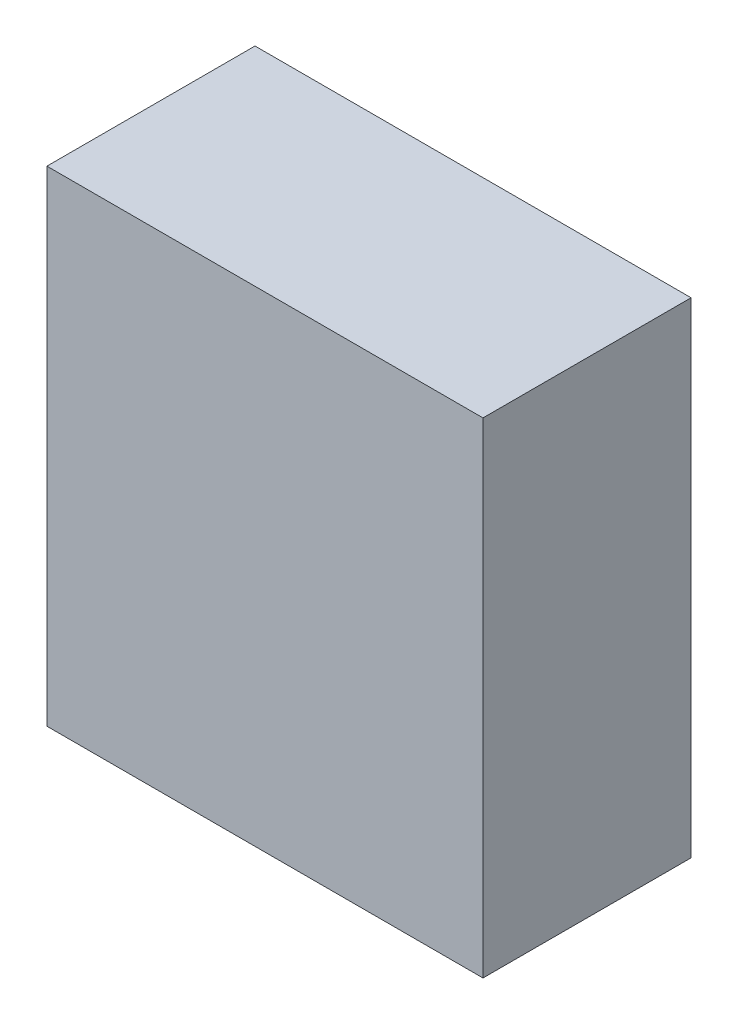
ISO-10303-21;
HEADER;
FILE_DESCRIPTION(('STEP AP214'),'2;1');
FILE_NAME('part.step','',(''),(''),'','','');
FILE_SCHEMA(('AUTOMOTIVE_DESIGN { 1 0 10303 214 1 1 1 1 }'));
ENDSEC;
DATA;
#1=APPLICATION_CONTEXT('core data for automotive mechanical design processes');
#2=APPLICATION_PROTOCOL_DEFINITION('international standard','automotive_design',2000,#1);
#3=PRODUCT_CONTEXT('',#1,'mechanical');
#4=PRODUCT('Part','Part','',(#3));
#5=PRODUCT_RELATED_PRODUCT_CATEGORY('part','',(#4));
#6=PRODUCT_DEFINITION_FORMATION('','',#4);
#7=PRODUCT_DEFINITION_CONTEXT('part definition',#1,'design');
#8=PRODUCT_DEFINITION('design','',#6,#7);
#9=PRODUCT_DEFINITION_SHAPE('','',#8);
#10=(LENGTH_UNIT() NAMED_UNIT(*) SI_UNIT(.MILLI.,.METRE.));
#11=(NAMED_UNIT(*) PLANE_ANGLE_UNIT() SI_UNIT($,.RADIAN.));
#12=(NAMED_UNIT(*) SI_UNIT($,.STERADIAN.) SOLID_ANGLE_UNIT());
#13=UNCERTAINTY_MEASURE_WITH_UNIT(LENGTH_MEASURE(1.E-05),#10,'distance_accuracy_value','');
#14=(GEOMETRIC_REPRESENTATION_CONTEXT(3) GLOBAL_UNCERTAINTY_ASSIGNED_CONTEXT((#13)) GLOBAL_UNIT_ASSIGNED_CONTEXT((#10,
#11,#12)) REPRESENTATION_CONTEXT('',''));
#15=CARTESIAN_POINT('',(0.,0.,0.));
#16=DIRECTION('',(0.,0.,1.));
#17=DIRECTION('',(1.,0.,0.));
#18=AXIS2_PLACEMENT_3D('',#15,#16,#17);
#19=CARTESIAN_POINT('',(-70.64375,-72.23125,-61.07176));
#20=DIRECTION('',(1.,0.,0.));
#21=DIRECTION('',(0.,0.,-1.));
#22=AXIS2_PLACEMENT_3D('',#19,#20,#21);
#23=PLANE('',#22);
#24=DIRECTION('',(0.,1.,0.));
#25=VECTOR('',#24,1.);
#26=CARTESIAN_POINT('',(-70.64375,-72.23125,6.35));
#27=LINE('',#26,#25);
#28=CARTESIAN_POINT('',(-70.64375,-78.58125,6.35));
#29=VERTEX_POINT('',#28);
#30=CARTESIAN_POINT('',(-70.64375,78.58125,6.35));
#31=VERTEX_POINT('',#30);
#32=EDGE_CURVE('E133',#29,#31,#27,.T.);
#33=ORIENTED_EDGE('',*,*,#32,.T.);
#34=DIRECTION('',(0.,0.,1.));
#35=VECTOR('',#34,1.);
#36=CARTESIAN_POINT('',(-70.64375,78.58125,-61.07176));
#37=LINE('',#36,#35);
#38=CARTESIAN_POINT('',(-70.64375,78.58125,-61.07176));
#39=VERTEX_POINT('',#38);
#40=EDGE_CURVE('E11',#39,#31,#37,.T.);
#41=ORIENTED_EDGE('',*,*,#40,.F.);
#42=DIRECTION('',(0.,1.,0.));
#43=VECTOR('',#42,1.);
#44=CARTESIAN_POINT('',(-70.64375,-72.23125,-61.07176));
#45=LINE('',#44,#43);
#46=CARTESIAN_POINT('',(-70.64375,-78.58125,-61.07176));
#47=VERTEX_POINT('',#46);
#48=EDGE_CURVE('E187',#47,#39,#45,.T.);
#49=ORIENTED_EDGE('',*,*,#48,.F.);
#50=DIRECTION('',(0.,0.,1.));
#51=VECTOR('',#50,1.);
#52=CARTESIAN_POINT('',(-70.64375,-78.58125,-61.07176));
#53=LINE('',#52,#51);
#54=EDGE_CURVE('E69',#47,#29,#53,.T.);
#55=ORIENTED_EDGE('',*,*,#54,.T.);
#56=EDGE_LOOP('',(#33,#41,#49,#55));
#57=FACE_BOUND('',#56,.T.);
#58=ADVANCED_FACE('F43',(#57),#23,.F.);
#59=CARTESIAN_POINT('',(-64.29375,78.58125,-61.07176));
#60=DIRECTION('',(0.,-1.,0.));
#61=DIRECTION('',(0.,0.,-1.));
#62=AXIS2_PLACEMENT_3D('',#59,#60,#61);
#63=PLANE('',#62);
#64=DIRECTION('',(1.,0.,0.));
#65=VECTOR('',#64,1.);
#66=CARTESIAN_POINT('',(-64.29375,78.58125,6.35));
#67=LINE('',#66,#65);
#68=CARTESIAN_POINT('',(70.64375,78.58125,6.35));
#69=VERTEX_POINT('',#68);
#70=EDGE_CURVE('E167',#31,#69,#67,.T.);
#71=ORIENTED_EDGE('',*,*,#70,.T.);
#72=DIRECTION('',(0.,0.,1.));
#73=VECTOR('',#72,1.);
#74=CARTESIAN_POINT('',(70.64375,78.58125,-61.07176));
#75=LINE('',#74,#73);
#76=CARTESIAN_POINT('',(70.64375,78.58125,-61.07176));
#77=VERTEX_POINT('',#76);
#78=EDGE_CURVE('E53',#77,#69,#75,.T.);
#79=ORIENTED_EDGE('',*,*,#78,.F.);
#80=DIRECTION('',(1.,0.,0.));
#81=VECTOR('',#80,1.);
#82=CARTESIAN_POINT('',(-64.29375,78.58125,-61.07176));
#83=LINE('',#82,#81);
#84=EDGE_CURVE('E191',#39,#77,#83,.T.);
#85=ORIENTED_EDGE('',*,*,#84,.F.);
#86=ORIENTED_EDGE('',*,*,#40,.T.);
#87=EDGE_LOOP('',(#71,#79,#85,#86));
#88=FACE_BOUND('',#87,.T.);
#89=ADVANCED_FACE('F205',(#88),#63,.F.);
#90=CARTESIAN_POINT('',(70.64375,-72.23125,-61.07176));
#91=DIRECTION('',(1.,0.,0.));
#92=DIRECTION('',(0.,0.,-1.));
#93=AXIS2_PLACEMENT_3D('',#90,#91,#92);
#94=PLANE('',#93);
#95=DIRECTION('',(0.,1.,0.));
#96=VECTOR('',#95,1.);
#97=CARTESIAN_POINT('',(70.64375,-72.23125,6.35));
#98=LINE('',#97,#96);
#99=CARTESIAN_POINT('',(70.64375,-78.58125,6.35));
#100=VERTEX_POINT('',#99);
#101=EDGE_CURVE('E175',#100,#69,#98,.T.);
#102=ORIENTED_EDGE('',*,*,#101,.F.);
#103=DIRECTION('',(0.,0.,1.));
#104=VECTOR('',#103,1.);
#105=CARTESIAN_POINT('',(70.64375,-78.58125,-61.07176));
#106=LINE('',#105,#104);
#107=CARTESIAN_POINT('',(70.64375,-78.58125,-61.07176));
#108=VERTEX_POINT('',#107);
#109=EDGE_CURVE('E171',#108,#100,#106,.T.);
#110=ORIENTED_EDGE('',*,*,#109,.F.);
#111=DIRECTION('',(0.,1.,0.));
#112=VECTOR('',#111,1.);
#113=CARTESIAN_POINT('',(70.64375,-72.23125,-61.07176));
#114=LINE('',#113,#112);
#115=EDGE_CURVE('E193',#108,#77,#114,.T.);
#116=ORIENTED_EDGE('',*,*,#115,.T.);
#117=ORIENTED_EDGE('',*,*,#78,.T.);
#118=EDGE_LOOP('',(#102,#110,#116,#117));
#119=FACE_BOUND('',#118,.T.);
#120=ADVANCED_FACE('F206',(#119),#94,.T.);
#121=CARTESIAN_POINT('',(-64.29375,-78.58125,-61.07176));
#122=DIRECTION('',(0.,-1.,0.));
#123=DIRECTION('',(0.,0.,-1.));
#124=AXIS2_PLACEMENT_3D('',#121,#122,#123);
#125=PLANE('',#124);
#126=DIRECTION('',(1.,0.,0.));
#127=VECTOR('',#126,1.);
#128=CARTESIAN_POINT('',(-64.29375,-78.58125,6.35));
#129=LINE('',#128,#127);
#130=EDGE_CURVE('E181',#29,#100,#129,.T.);
#131=ORIENTED_EDGE('',*,*,#130,.F.);
#132=ORIENTED_EDGE('',*,*,#54,.F.);
#133=DIRECTION('',(1.,0.,0.));
#134=VECTOR('',#133,1.);
#135=CARTESIAN_POINT('',(-64.29375,-78.58125,-61.07176));
#136=LINE('',#135,#134);
#137=EDGE_CURVE('E47',#47,#108,#136,.T.);
#138=ORIENTED_EDGE('',*,*,#137,.T.);
#139=ORIENTED_EDGE('',*,*,#109,.T.);
#140=EDGE_LOOP('',(#131,#132,#138,#139));
#141=FACE_BOUND('',#140,.T.);
#142=ADVANCED_FACE('F200',(#141),#125,.T.);
#143=CARTESIAN_POINT('',(0.,0.,-61.07176));
#144=DIRECTION('',(0.,0.,-1.));
#145=DIRECTION('',(-1.,0.,0.));
#146=AXIS2_PLACEMENT_3D('',#143,#144,#145);
#147=PLANE('',#146);
#148=DIRECTION('',(0.,1.,0.));
#149=VECTOR('',#148,1.);
#150=CARTESIAN_POINT('',(-64.29375,-72.23125,-61.07176));
#151=LINE('',#150,#149);
#152=CARTESIAN_POINT('',(-64.29375,-72.23125,-61.07176));
#153=VERTEX_POINT('',#152);
#154=CARTESIAN_POINT('',(-64.29375,72.23125,-61.07176));
#155=VERTEX_POINT('',#154);
#156=EDGE_CURVE('E113',#153,#155,#151,.T.);
#157=ORIENTED_EDGE('',*,*,#156,.F.);
#158=DIRECTION('',(1.,0.,0.));
#159=VECTOR('',#158,1.);
#160=CARTESIAN_POINT('',(-64.29375,-72.23125,-61.07176));
#161=LINE('',#160,#159);
#162=CARTESIAN_POINT('',(64.29375,-72.23125,-61.07176));
#163=VERTEX_POINT('',#162);
#164=EDGE_CURVE('E141',#153,#163,#161,.T.);
#165=ORIENTED_EDGE('',*,*,#164,.T.);
#166=DIRECTION('',(0.,1.,0.));
#167=VECTOR('',#166,1.);
#168=CARTESIAN_POINT('',(64.29375,-72.23125,-61.07176));
#169=LINE('',#168,#167);
#170=CARTESIAN_POINT('',(64.29375,72.23125,-61.07176));
#171=VERTEX_POINT('',#170);
#172=EDGE_CURVE('E61',#163,#171,#169,.T.);
#173=ORIENTED_EDGE('',*,*,#172,.T.);
#174=DIRECTION('',(1.,0.,0.));
#175=VECTOR('',#174,1.);
#176=CARTESIAN_POINT('',(-64.29375,72.23125,-61.07176));
#177=LINE('',#176,#175);
#178=EDGE_CURVE('E125',#155,#171,#177,.T.);
#179=ORIENTED_EDGE('',*,*,#178,.F.);
#180=EDGE_LOOP('',(#157,#165,#173,#179));
#181=FACE_BOUND('',#180,.T.);
#182=ORIENTED_EDGE('',*,*,#48,.T.);
#183=ORIENTED_EDGE('',*,*,#84,.T.);
#184=ORIENTED_EDGE('',*,*,#115,.F.);
#185=ORIENTED_EDGE('',*,*,#137,.F.);
#186=EDGE_LOOP('',(#182,#183,#184,#185));
#187=FACE_BOUND('',#186,.T.);
#188=ADVANCED_FACE('F136',(#181,#187),#147,.T.);
#189=CARTESIAN_POINT('',(0.,0.,6.35));
#190=DIRECTION('',(0.,0.,-1.));
#191=DIRECTION('',(-1.,0.,0.));
#192=AXIS2_PLACEMENT_3D('',#189,#190,#191);
#193=PLANE('',#192);
#194=ORIENTED_EDGE('',*,*,#32,.F.);
#195=ORIENTED_EDGE('',*,*,#130,.T.);
#196=ORIENTED_EDGE('',*,*,#101,.T.);
#197=ORIENTED_EDGE('',*,*,#70,.F.);
#198=EDGE_LOOP('',(#194,#195,#196,#197));
#199=FACE_BOUND('',#198,.T.);
#200=ADVANCED_FACE('F45',(#199),#193,.F.);
#201=CARTESIAN_POINT('',(-64.29375,-72.23125,-61.07176));
#202=DIRECTION('',(1.,0.,0.));
#203=DIRECTION('',(0.,0.,-1.));
#204=AXIS2_PLACEMENT_3D('',#201,#202,#203);
#205=PLANE('',#204);
#206=DIRECTION('',(0.,1.,0.));
#207=VECTOR('',#206,1.);
#208=CARTESIAN_POINT('',(-64.29375,-72.23125,0.));
#209=LINE('',#208,#207);
#210=CARTESIAN_POINT('',(-64.29375,-72.23125,0.));
#211=VERTEX_POINT('',#210);
#212=CARTESIAN_POINT('',(-64.29375,72.23125,0.));
#213=VERTEX_POINT('',#212);
#214=EDGE_CURVE('E146',#211,#213,#209,.T.);
#215=ORIENTED_EDGE('',*,*,#214,.F.);
#216=DIRECTION('',(0.,0.,1.));
#217=VECTOR('',#216,1.);
#218=CARTESIAN_POINT('',(-64.29375,-72.23125,-61.07176));
#219=LINE('',#218,#217);
#220=EDGE_CURVE('E119',#153,#211,#219,.T.);
#221=ORIENTED_EDGE('',*,*,#220,.F.);
#222=ORIENTED_EDGE('',*,*,#156,.T.);
#223=DIRECTION('',(0.,0.,1.));
#224=VECTOR('',#223,1.);
#225=CARTESIAN_POINT('',(-64.29375,72.23125,-61.07176));
#226=LINE('',#225,#224);
#227=EDGE_CURVE('E117',#155,#213,#226,.T.);
#228=ORIENTED_EDGE('',*,*,#227,.T.);
#229=EDGE_LOOP('',(#215,#221,#222,#228));
#230=FACE_BOUND('',#229,.T.);
#231=ADVANCED_FACE('F116',(#230),#205,.T.);
#232=CARTESIAN_POINT('',(-64.29375,72.23125,-61.07176));
#233=DIRECTION('',(0.,-1.,0.));
#234=DIRECTION('',(0.,0.,-1.));
#235=AXIS2_PLACEMENT_3D('',#232,#233,#234);
#236=PLANE('',#235);
#237=DIRECTION('',(1.,0.,0.));
#238=VECTOR('',#237,1.);
#239=CARTESIAN_POINT('',(-64.29375,72.23125,0.));
#240=LINE('',#239,#238);
#241=CARTESIAN_POINT('',(64.29375,72.23125,0.));
#242=VERTEX_POINT('',#241);
#243=EDGE_CURVE('E131',#213,#242,#240,.T.);
#244=ORIENTED_EDGE('',*,*,#243,.F.);
#245=ORIENTED_EDGE('',*,*,#227,.F.);
#246=ORIENTED_EDGE('',*,*,#178,.T.);
#247=DIRECTION('',(0.,0.,1.));
#248=VECTOR('',#247,1.);
#249=CARTESIAN_POINT('',(64.29375,72.23125,-61.07176));
#250=LINE('',#249,#248);
#251=EDGE_CURVE('E134',#171,#242,#250,.T.);
#252=ORIENTED_EDGE('',*,*,#251,.T.);
#253=EDGE_LOOP('',(#244,#245,#246,#252));
#254=FACE_BOUND('',#253,.T.);
#255=ADVANCED_FACE('F129',(#254),#236,.T.);
#256=CARTESIAN_POINT('',(64.29375,-72.23125,-61.07176));
#257=DIRECTION('',(1.,0.,0.));
#258=DIRECTION('',(0.,0.,-1.));
#259=AXIS2_PLACEMENT_3D('',#256,#257,#258);
#260=PLANE('',#259);
#261=DIRECTION('',(0.,1.,0.));
#262=VECTOR('',#261,1.);
#263=CARTESIAN_POINT('',(64.29375,-72.23125,0.));
#264=LINE('',#263,#262);
#265=CARTESIAN_POINT('',(64.29375,-72.23125,0.));
#266=VERTEX_POINT('',#265);
#267=EDGE_CURVE('E151',#266,#242,#264,.T.);
#268=ORIENTED_EDGE('',*,*,#267,.T.);
#269=ORIENTED_EDGE('',*,*,#251,.F.);
#270=ORIENTED_EDGE('',*,*,#172,.F.);
#271=DIRECTION('',(0.,0.,1.));
#272=VECTOR('',#271,1.);
#273=CARTESIAN_POINT('',(64.29375,-72.23125,-61.07176));
#274=LINE('',#273,#272);
#275=EDGE_CURVE('E160',#163,#266,#274,.T.);
#276=ORIENTED_EDGE('',*,*,#275,.T.);
#277=EDGE_LOOP('',(#268,#269,#270,#276));
#278=FACE_BOUND('',#277,.T.);
#279=ADVANCED_FACE('F233',(#278),#260,.F.);
#280=CARTESIAN_POINT('',(-64.29375,-72.23125,-61.07176));
#281=DIRECTION('',(0.,-1.,0.));
#282=DIRECTION('',(0.,0.,-1.));
#283=AXIS2_PLACEMENT_3D('',#280,#281,#282);
#284=PLANE('',#283);
#285=DIRECTION('',(1.,0.,0.));
#286=VECTOR('',#285,1.);
#287=CARTESIAN_POINT('',(-64.29375,-72.23125,0.));
#288=LINE('',#287,#286);
#289=EDGE_CURVE('E126',#211,#266,#288,.T.);
#290=ORIENTED_EDGE('',*,*,#289,.T.);
#291=ORIENTED_EDGE('',*,*,#275,.F.);
#292=ORIENTED_EDGE('',*,*,#164,.F.);
#293=ORIENTED_EDGE('',*,*,#220,.T.);
#294=EDGE_LOOP('',(#290,#291,#292,#293));
#295=FACE_BOUND('',#294,.T.);
#296=ADVANCED_FACE('F238',(#295),#284,.F.);
#297=CARTESIAN_POINT('',(0.,0.,0.));
#298=DIRECTION('',(0.,0.,-1.));
#299=DIRECTION('',(-1.,0.,0.));
#300=AXIS2_PLACEMENT_3D('',#297,#298,#299);
#301=PLANE('',#300);
#302=ORIENTED_EDGE('',*,*,#214,.T.);
#303=ORIENTED_EDGE('',*,*,#243,.T.);
#304=ORIENTED_EDGE('',*,*,#267,.F.);
#305=ORIENTED_EDGE('',*,*,#289,.F.);
#306=EDGE_LOOP('',(#302,#303,#304,#305));
#307=FACE_BOUND('',#306,.T.);
#308=ADVANCED_FACE('F241',(#307),#301,.T.);
#309=CLOSED_SHELL('',(#58,#89,#120,#142,#188,#200,#231,#255,#279,#296,#308));
#310=MANIFOLD_SOLID_BREP('B2',#309);
#311=ADVANCED_BREP_SHAPE_REPRESENTATION('',(#18,#310),#14);
#312=SHAPE_DEFINITION_REPRESENTATION(#9,#311);
ENDSEC;
END-ISO-10303-21;
